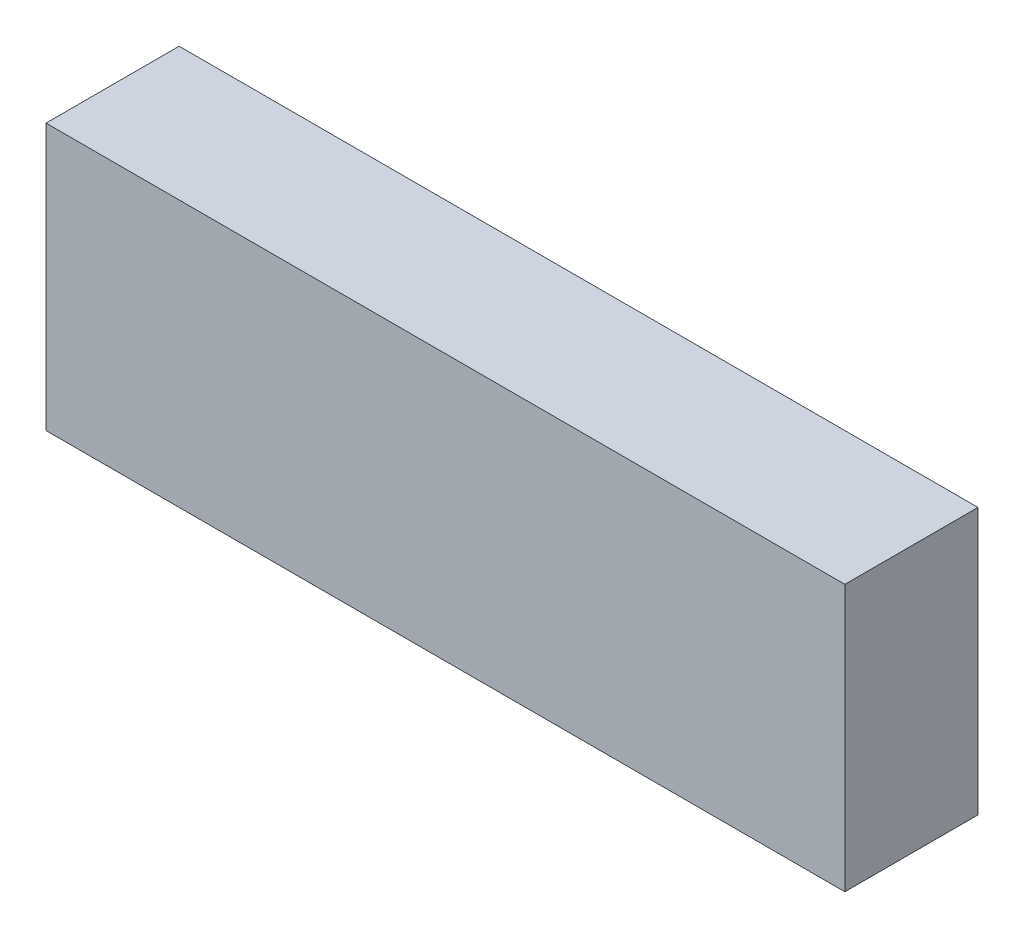
ISO-10303-21;
HEADER;
FILE_DESCRIPTION(('STEP AP214'),'2;1');
FILE_NAME('part.step','',(''),(''),'','','');
FILE_SCHEMA(('AUTOMOTIVE_DESIGN { 1 0 10303 214 1 1 1 1 }'));
ENDSEC;
DATA;
#1=APPLICATION_CONTEXT('core data for automotive mechanical design processes');
#2=APPLICATION_PROTOCOL_DEFINITION('international standard','automotive_design',2000,#1);
#3=PRODUCT_CONTEXT('',#1,'mechanical');
#4=PRODUCT('Part','Part','',(#3));
#5=PRODUCT_RELATED_PRODUCT_CATEGORY('part','',(#4));
#6=PRODUCT_DEFINITION_FORMATION('','',#4);
#7=PRODUCT_DEFINITION_CONTEXT('part definition',#1,'design');
#8=PRODUCT_DEFINITION('design','',#6,#7);
#9=PRODUCT_DEFINITION_SHAPE('','',#8);
#10=(LENGTH_UNIT() NAMED_UNIT(*) SI_UNIT(.MILLI.,.METRE.));
#11=(NAMED_UNIT(*) PLANE_ANGLE_UNIT() SI_UNIT($,.RADIAN.));
#12=(NAMED_UNIT(*) SI_UNIT($,.STERADIAN.) SOLID_ANGLE_UNIT());
#13=UNCERTAINTY_MEASURE_WITH_UNIT(LENGTH_MEASURE(1.E-05),#10,'distance_accuracy_value','');
#14=(GEOMETRIC_REPRESENTATION_CONTEXT(3) GLOBAL_UNCERTAINTY_ASSIGNED_CONTEXT((#13)) GLOBAL_UNIT_ASSIGNED_CONTEXT((#10,
#11,#12)) REPRESENTATION_CONTEXT('',''));
#15=CARTESIAN_POINT('',(0.,0.,0.));
#16=DIRECTION('',(0.,0.,1.));
#17=DIRECTION('',(1.,0.,0.));
#18=AXIS2_PLACEMENT_3D('',#15,#16,#17);
#19=CARTESIAN_POINT('',(-1.975,-1.225,0.));
#20=DIRECTION('',(1.,0.,0.));
#21=DIRECTION('',(0.,0.,1.));
#22=AXIS2_PLACEMENT_3D('',#19,#20,#21);
#23=PLANE('',#22);
#24=DIRECTION('',(0.,1.,0.));
#25=VECTOR('',#24,1.);
#26=CARTESIAN_POINT('',(-1.975,-1.225,0.1));
#27=LINE('',#26,#25);
#28=CARTESIAN_POINT('',(-1.975,-1.225,0.1));
#29=VERTEX_POINT('',#28);
#30=CARTESIAN_POINT('',(-1.975,-1.025,0.1));
#31=VERTEX_POINT('',#30);
#32=EDGE_CURVE('E11',#29,#31,#27,.T.);
#33=ORIENTED_EDGE('',*,*,#32,.T.);
#34=DIRECTION('',(0.,0.,1.));
#35=VECTOR('',#34,1.);
#36=CARTESIAN_POINT('',(-1.975,-1.025,0.));
#37=LINE('',#36,#35);
#38=CARTESIAN_POINT('',(-1.975,-1.025,0.));
#39=VERTEX_POINT('',#38);
#40=EDGE_CURVE('E24',#39,#31,#37,.T.);
#41=ORIENTED_EDGE('',*,*,#40,.F.);
#42=DIRECTION('',(0.,1.,0.));
#43=VECTOR('',#42,1.);
#44=CARTESIAN_POINT('',(-1.975,-1.225,0.));
#45=LINE('',#44,#43);
#46=CARTESIAN_POINT('',(-1.975,-1.225,0.));
#47=VERTEX_POINT('',#46);
#48=EDGE_CURVE('E86',#47,#39,#45,.T.);
#49=ORIENTED_EDGE('',*,*,#48,.F.);
#50=DIRECTION('',(0.,0.,1.));
#51=VECTOR('',#50,1.);
#52=CARTESIAN_POINT('',(-1.975,-1.225,0.));
#53=LINE('',#52,#51);
#54=EDGE_CURVE('E36',#47,#29,#53,.T.);
#55=ORIENTED_EDGE('',*,*,#54,.T.);
#56=EDGE_LOOP('',(#33,#41,#49,#55));
#57=FACE_BOUND('',#56,.T.);
#58=ADVANCED_FACE('F17',(#57),#23,.F.);
#59=CARTESIAN_POINT('',(-1.375,-1.225,0.));
#60=DIRECTION('',(1.,0.,0.));
#61=DIRECTION('',(0.,0.,1.));
#62=AXIS2_PLACEMENT_3D('',#59,#60,#61);
#63=PLANE('',#62);
#64=DIRECTION('',(0.,0.,1.));
#65=VECTOR('',#64,1.);
#66=CARTESIAN_POINT('',(-1.375,-1.225,0.));
#67=LINE('',#66,#65);
#68=CARTESIAN_POINT('',(-1.375,-1.225,0.));
#69=VERTEX_POINT('',#68);
#70=CARTESIAN_POINT('',(-1.375,-1.225,0.1));
#71=VERTEX_POINT('',#70);
#72=EDGE_CURVE('E83',#69,#71,#67,.T.);
#73=ORIENTED_EDGE('',*,*,#72,.F.);
#74=DIRECTION('',(0.,1.,0.));
#75=VECTOR('',#74,1.);
#76=CARTESIAN_POINT('',(-1.375,-1.225,0.));
#77=LINE('',#76,#75);
#78=CARTESIAN_POINT('',(-1.375,-1.025,0.));
#79=VERTEX_POINT('',#78);
#80=EDGE_CURVE('E63',#69,#79,#77,.T.);
#81=ORIENTED_EDGE('',*,*,#80,.T.);
#82=DIRECTION('',(0.,0.,1.));
#83=VECTOR('',#82,1.);
#84=CARTESIAN_POINT('',(-1.375,-1.025,0.));
#85=LINE('',#84,#83);
#86=CARTESIAN_POINT('',(-1.375,-1.025,0.1));
#87=VERTEX_POINT('',#86);
#88=EDGE_CURVE('E57',#79,#87,#85,.T.);
#89=ORIENTED_EDGE('',*,*,#88,.T.);
#90=DIRECTION('',(0.,1.,0.));
#91=VECTOR('',#90,1.);
#92=CARTESIAN_POINT('',(-1.375,-1.225,0.1));
#93=LINE('',#92,#91);
#94=EDGE_CURVE('E60',#71,#87,#93,.T.);
#95=ORIENTED_EDGE('',*,*,#94,.F.);
#96=EDGE_LOOP('',(#73,#81,#89,#95));
#97=FACE_BOUND('',#96,.T.);
#98=ADVANCED_FACE('F59',(#97),#63,.T.);
#99=CARTESIAN_POINT('',(-1.975,-1.225,0.));
#100=DIRECTION('',(0.,1.,0.));
#101=DIRECTION('',(0.,0.,1.));
#102=AXIS2_PLACEMENT_3D('',#99,#100,#101);
#103=PLANE('',#102);
#104=ORIENTED_EDGE('',*,*,#72,.T.);
#105=DIRECTION('',(1.,0.,0.));
#106=VECTOR('',#105,1.);
#107=CARTESIAN_POINT('',(-1.975,-1.225,0.1));
#108=LINE('',#107,#106);
#109=EDGE_CURVE('E71',#29,#71,#108,.T.);
#110=ORIENTED_EDGE('',*,*,#109,.F.);
#111=ORIENTED_EDGE('',*,*,#54,.F.);
#112=DIRECTION('',(1.,0.,0.));
#113=VECTOR('',#112,1.);
#114=CARTESIAN_POINT('',(-1.975,-1.225,0.));
#115=LINE('',#114,#113);
#116=EDGE_CURVE('E76',#47,#69,#115,.T.);
#117=ORIENTED_EDGE('',*,*,#116,.T.);
#118=EDGE_LOOP('',(#104,#110,#111,#117));
#119=FACE_BOUND('',#118,.T.);
#120=ADVANCED_FACE('F91',(#119),#103,.F.);
#121=CARTESIAN_POINT('',(-1.975,-1.025,0.));
#122=DIRECTION('',(0.,1.,0.));
#123=DIRECTION('',(0.,0.,1.));
#124=AXIS2_PLACEMENT_3D('',#121,#122,#123);
#125=PLANE('',#124);
#126=DIRECTION('',(1.,0.,0.));
#127=VECTOR('',#126,1.);
#128=CARTESIAN_POINT('',(-1.975,-1.025,0.));
#129=LINE('',#128,#127);
#130=EDGE_CURVE('E74',#39,#79,#129,.T.);
#131=ORIENTED_EDGE('',*,*,#130,.F.);
#132=ORIENTED_EDGE('',*,*,#40,.T.);
#133=DIRECTION('',(1.,0.,0.));
#134=VECTOR('',#133,1.);
#135=CARTESIAN_POINT('',(-1.975,-1.025,0.1));
#136=LINE('',#135,#134);
#137=EDGE_CURVE('E69',#31,#87,#136,.T.);
#138=ORIENTED_EDGE('',*,*,#137,.T.);
#139=ORIENTED_EDGE('',*,*,#88,.F.);
#140=EDGE_LOOP('',(#131,#132,#138,#139));
#141=FACE_BOUND('',#140,.T.);
#142=ADVANCED_FACE('F73',(#141),#125,.T.);
#143=CARTESIAN_POINT('',(-1.975,-1.225,0.));
#144=DIRECTION('',(0.,0.,1.));
#145=DIRECTION('',(1.,0.,0.));
#146=AXIS2_PLACEMENT_3D('',#143,#144,#145);
#147=PLANE('',#146);
#148=ORIENTED_EDGE('',*,*,#130,.T.);
#149=ORIENTED_EDGE('',*,*,#80,.F.);
#150=ORIENTED_EDGE('',*,*,#116,.F.);
#151=ORIENTED_EDGE('',*,*,#48,.T.);
#152=EDGE_LOOP('',(#148,#149,#150,#151));
#153=FACE_BOUND('',#152,.T.);
#154=ADVANCED_FACE('F89',(#153),#147,.F.);
#155=CARTESIAN_POINT('',(-1.975,-1.225,0.1));
#156=DIRECTION('',(0.,0.,1.));
#157=DIRECTION('',(1.,0.,0.));
#158=AXIS2_PLACEMENT_3D('',#155,#156,#157);
#159=PLANE('',#158);
#160=ORIENTED_EDGE('',*,*,#32,.F.);
#161=ORIENTED_EDGE('',*,*,#109,.T.);
#162=ORIENTED_EDGE('',*,*,#94,.T.);
#163=ORIENTED_EDGE('',*,*,#137,.F.);
#164=EDGE_LOOP('',(#160,#161,#162,#163));
#165=FACE_BOUND('',#164,.T.);
#166=ADVANCED_FACE('F68',(#165),#159,.T.);
#167=CLOSED_SHELL('',(#58,#98,#120,#142,#154,#166));
#168=MANIFOLD_SOLID_BREP('B1',#167);
#169=ADVANCED_BREP_SHAPE_REPRESENTATION('',(#18,#168),#14);
#170=SHAPE_DEFINITION_REPRESENTATION(#9,#169);
ENDSEC;
END-ISO-10303-21;
